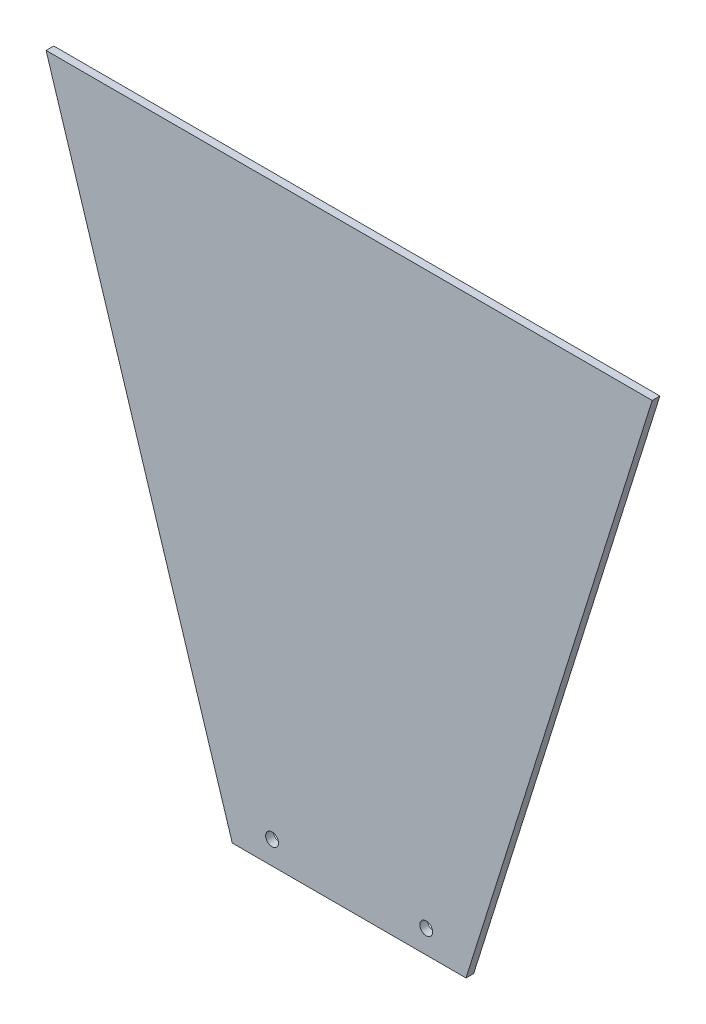
ISO-10303-21;
HEADER;
FILE_DESCRIPTION(('STEP AP214'),'2;1');
FILE_NAME('part.step','',(''),(''),'','','');
FILE_SCHEMA(('AUTOMOTIVE_DESIGN { 1 0 10303 214 1 1 1 1 }'));
ENDSEC;
DATA;
#1=APPLICATION_CONTEXT('core data for automotive mechanical design processes');
#2=APPLICATION_PROTOCOL_DEFINITION('international standard','automotive_design',2000,#1);
#3=PRODUCT_CONTEXT('',#1,'mechanical');
#4=PRODUCT('Part','Part','',(#3));
#5=PRODUCT_RELATED_PRODUCT_CATEGORY('part','',(#4));
#6=PRODUCT_DEFINITION_FORMATION('','',#4);
#7=PRODUCT_DEFINITION_CONTEXT('part definition',#1,'design');
#8=PRODUCT_DEFINITION('design','',#6,#7);
#9=PRODUCT_DEFINITION_SHAPE('','',#8);
#10=(LENGTH_UNIT() NAMED_UNIT(*) SI_UNIT(.MILLI.,.METRE.));
#11=(NAMED_UNIT(*) PLANE_ANGLE_UNIT() SI_UNIT($,.RADIAN.));
#12=(NAMED_UNIT(*) SI_UNIT($,.STERADIAN.) SOLID_ANGLE_UNIT());
#13=UNCERTAINTY_MEASURE_WITH_UNIT(LENGTH_MEASURE(1.E-05),#10,'distance_accuracy_value','');
#14=(GEOMETRIC_REPRESENTATION_CONTEXT(3) GLOBAL_UNCERTAINTY_ASSIGNED_CONTEXT((#13)) GLOBAL_UNIT_ASSIGNED_CONTEXT((#10,
#11,#12)) REPRESENTATION_CONTEXT('',''));
#15=CARTESIAN_POINT('',(0.,0.,0.));
#16=DIRECTION('',(0.,0.,1.));
#17=DIRECTION('',(1.,0.,0.));
#18=AXIS2_PLACEMENT_3D('',#15,#16,#17);
#19=CARTESIAN_POINT('',(0.,0.,3.));
#20=DIRECTION('',(0.,0.,-1.));
#21=DIRECTION('',(-1.,0.,0.));
#22=AXIS2_PLACEMENT_3D('',#19,#20,#21);
#23=PLANE('',#22);
#24=DIRECTION('',(1.,0.,0.));
#25=VECTOR('',#24,1.);
#26=CARTESIAN_POINT('',(-45.5,0.,3.));
#27=LINE('',#26,#25);
#28=CARTESIAN_POINT('',(-45.5,0.,3.));
#29=VERTEX_POINT('',#28);
#30=CARTESIAN_POINT('',(45.5,0.,3.));
#31=VERTEX_POINT('',#30);
#32=EDGE_CURVE('E85',#29,#31,#27,.T.);
#33=ORIENTED_EDGE('',*,*,#32,.T.);
#34=DIRECTION('',(0.299450668285817,0.954111784469293,0.));
#35=VECTOR('',#34,1.);
#36=CARTESIAN_POINT('',(118.,231.,3.));
#37=LINE('',#36,#35);
#38=CARTESIAN_POINT('',(118.,231.,3.));
#39=VERTEX_POINT('',#38);
#40=EDGE_CURVE('E80',#31,#39,#37,.T.);
#41=ORIENTED_EDGE('',*,*,#40,.T.);
#42=DIRECTION('',(-1.,0.,0.));
#43=VECTOR('',#42,1.);
#44=CARTESIAN_POINT('',(-118.,231.,3.));
#45=LINE('',#44,#43);
#46=CARTESIAN_POINT('',(-118.,231.,3.));
#47=VERTEX_POINT('',#46);
#48=EDGE_CURVE('E83',#39,#47,#45,.T.);
#49=ORIENTED_EDGE('',*,*,#48,.T.);
#50=DIRECTION('',(0.299450668285817,-0.954111784469292,0.));
#51=VECTOR('',#50,1.);
#52=CARTESIAN_POINT('',(-45.5,0.,3.));
#53=LINE('',#52,#51);
#54=EDGE_CURVE('E50',#47,#29,#53,.T.);
#55=ORIENTED_EDGE('',*,*,#54,.T.);
#56=EDGE_LOOP('',(#33,#41,#49,#55));
#57=FACE_BOUND('',#56,.T.);
#58=CARTESIAN_POINT('',(-30.,9.,3.));
#59=DIRECTION('',(0.,0.,1.));
#60=DIRECTION('',(1.,0.,0.));
#61=AXIS2_PLACEMENT_3D('',#58,#59,#60);
#62=CIRCLE('',#61,2.5);
#63=CARTESIAN_POINT('',(-27.5,9.,3.));
#64=VERTEX_POINT('',#63);
#65=EDGE_CURVE('E100',#64,#64,#62,.T.);
#66=ORIENTED_EDGE('',*,*,#65,.F.);
#67=EDGE_LOOP('',(#66));
#68=FACE_BOUND('',#67,.T.);
#69=CARTESIAN_POINT('',(30.,9.,3.));
#70=DIRECTION('',(0.,0.,1.));
#71=DIRECTION('',(1.,0.,0.));
#72=AXIS2_PLACEMENT_3D('',#69,#70,#71);
#73=CIRCLE('',#72,2.5);
#74=CARTESIAN_POINT('',(32.5,9.,3.));
#75=VERTEX_POINT('',#74);
#76=EDGE_CURVE('E115',#75,#75,#73,.T.);
#77=ORIENTED_EDGE('',*,*,#76,.F.);
#78=EDGE_LOOP('',(#77));
#79=FACE_BOUND('',#78,.T.);
#80=ADVANCED_FACE('F33',(#57,#68,#79),#23,.F.);
#81=CARTESIAN_POINT('',(0.,0.,0.));
#82=DIRECTION('',(0.,0.,-1.));
#83=DIRECTION('',(-1.,0.,0.));
#84=AXIS2_PLACEMENT_3D('',#81,#82,#83);
#85=PLANE('',#84);
#86=CARTESIAN_POINT('',(-30.,9.,0.));
#87=DIRECTION('',(0.,0.,1.));
#88=DIRECTION('',(1.,0.,0.));
#89=AXIS2_PLACEMENT_3D('',#86,#87,#88);
#90=CIRCLE('',#89,2.5);
#91=CARTESIAN_POINT('',(-27.5,9.,0.));
#92=VERTEX_POINT('',#91);
#93=EDGE_CURVE('E112',#92,#92,#90,.T.);
#94=ORIENTED_EDGE('',*,*,#93,.T.);
#95=EDGE_LOOP('',(#94));
#96=FACE_BOUND('',#95,.T.);
#97=DIRECTION('',(1.,0.,0.));
#98=VECTOR('',#97,1.);
#99=CARTESIAN_POINT('',(-45.5,0.,0.));
#100=LINE('',#99,#98);
#101=CARTESIAN_POINT('',(-45.5,0.,0.));
#102=VERTEX_POINT('',#101);
#103=CARTESIAN_POINT('',(45.5,0.,0.));
#104=VERTEX_POINT('',#103);
#105=EDGE_CURVE('E97',#102,#104,#100,.T.);
#106=ORIENTED_EDGE('',*,*,#105,.F.);
#107=DIRECTION('',(0.299450668285817,-0.954111784469292,0.));
#108=VECTOR('',#107,1.);
#109=CARTESIAN_POINT('',(-45.5,0.,0.));
#110=LINE('',#109,#108);
#111=CARTESIAN_POINT('',(-118.,231.,0.));
#112=VERTEX_POINT('',#111);
#113=EDGE_CURVE('E73',#112,#102,#110,.T.);
#114=ORIENTED_EDGE('',*,*,#113,.F.);
#115=DIRECTION('',(-1.,0.,0.));
#116=VECTOR('',#115,1.);
#117=CARTESIAN_POINT('',(-118.,231.,0.));
#118=LINE('',#117,#116);
#119=CARTESIAN_POINT('',(118.,231.,0.));
#120=VERTEX_POINT('',#119);
#121=EDGE_CURVE('E67',#120,#112,#118,.T.);
#122=ORIENTED_EDGE('',*,*,#121,.F.);
#123=DIRECTION('',(0.299450668285817,0.954111784469293,0.));
#124=VECTOR('',#123,1.);
#125=CARTESIAN_POINT('',(118.,231.,0.));
#126=LINE('',#125,#124);
#127=EDGE_CURVE('E89',#104,#120,#126,.T.);
#128=ORIENTED_EDGE('',*,*,#127,.F.);
#129=EDGE_LOOP('',(#106,#114,#122,#128));
#130=FACE_BOUND('',#129,.T.);
#131=CARTESIAN_POINT('',(30.,9.,0.));
#132=DIRECTION('',(0.,0.,1.));
#133=DIRECTION('',(1.,0.,0.));
#134=AXIS2_PLACEMENT_3D('',#131,#132,#133);
#135=CIRCLE('',#134,2.5);
#136=CARTESIAN_POINT('',(32.5,9.,0.));
#137=VERTEX_POINT('',#136);
#138=EDGE_CURVE('E118',#137,#137,#135,.T.);
#139=ORIENTED_EDGE('',*,*,#138,.T.);
#140=EDGE_LOOP('',(#139));
#141=FACE_BOUND('',#140,.T.);
#142=ADVANCED_FACE('F108',(#96,#130,#141),#85,.T.);
#143=CARTESIAN_POINT('',(-45.5,0.,3.));
#144=DIRECTION('',(0.,1.,0.));
#145=DIRECTION('',(0.,0.,1.));
#146=AXIS2_PLACEMENT_3D('',#143,#144,#145);
#147=PLANE('',#146);
#148=ORIENTED_EDGE('',*,*,#105,.T.);
#149=DIRECTION('',(0.,0.,-1.));
#150=VECTOR('',#149,1.);
#151=CARTESIAN_POINT('',(45.5,0.,3.));
#152=LINE('',#151,#150);
#153=EDGE_CURVE('E11',#31,#104,#152,.T.);
#154=ORIENTED_EDGE('',*,*,#153,.F.);
#155=ORIENTED_EDGE('',*,*,#32,.F.);
#156=DIRECTION('',(0.,0.,-1.));
#157=VECTOR('',#156,1.);
#158=CARTESIAN_POINT('',(-45.5,0.,3.));
#159=LINE('',#158,#157);
#160=EDGE_CURVE('E93',#29,#102,#159,.T.);
#161=ORIENTED_EDGE('',*,*,#160,.T.);
#162=EDGE_LOOP('',(#148,#154,#155,#161));
#163=FACE_BOUND('',#162,.T.);
#164=ADVANCED_FACE('F35',(#163),#147,.F.);
#165=CARTESIAN_POINT('',(118.,231.,3.));
#166=DIRECTION('',(-0.954111784469293,0.299450668285817,0.));
#167=DIRECTION('',(-0.299450668285817,-0.954111784469293,0.));
#168=AXIS2_PLACEMENT_3D('',#165,#166,#167);
#169=PLANE('',#168);
#170=ORIENTED_EDGE('',*,*,#127,.T.);
#171=DIRECTION('',(0.,0.,-1.));
#172=VECTOR('',#171,1.);
#173=CARTESIAN_POINT('',(118.,231.,3.));
#174=LINE('',#173,#172);
#175=EDGE_CURVE('E42',#39,#120,#174,.T.);
#176=ORIENTED_EDGE('',*,*,#175,.F.);
#177=ORIENTED_EDGE('',*,*,#40,.F.);
#178=ORIENTED_EDGE('',*,*,#153,.T.);
#179=EDGE_LOOP('',(#170,#176,#177,#178));
#180=FACE_BOUND('',#179,.T.);
#181=ADVANCED_FACE('F88',(#180),#169,.F.);
#182=CARTESIAN_POINT('',(-118.,231.,3.));
#183=DIRECTION('',(0.,-1.,0.));
#184=DIRECTION('',(0.,0.,-1.));
#185=AXIS2_PLACEMENT_3D('',#182,#183,#184);
#186=PLANE('',#185);
#187=ORIENTED_EDGE('',*,*,#121,.T.);
#188=DIRECTION('',(0.,0.,-1.));
#189=VECTOR('',#188,1.);
#190=CARTESIAN_POINT('',(-118.,231.,3.));
#191=LINE('',#190,#189);
#192=EDGE_CURVE('E90',#47,#112,#191,.T.);
#193=ORIENTED_EDGE('',*,*,#192,.F.);
#194=ORIENTED_EDGE('',*,*,#48,.F.);
#195=ORIENTED_EDGE('',*,*,#175,.T.);
#196=EDGE_LOOP('',(#187,#193,#194,#195));
#197=FACE_BOUND('',#196,.T.);
#198=ADVANCED_FACE('F91',(#197),#186,.F.);
#199=CARTESIAN_POINT('',(-45.5,0.,3.));
#200=DIRECTION('',(0.954111784469292,0.299450668285817,0.));
#201=DIRECTION('',(-0.299450668285817,0.954111784469292,0.));
#202=AXIS2_PLACEMENT_3D('',#199,#200,#201);
#203=PLANE('',#202);
#204=ORIENTED_EDGE('',*,*,#113,.T.);
#205=ORIENTED_EDGE('',*,*,#160,.F.);
#206=ORIENTED_EDGE('',*,*,#54,.F.);
#207=ORIENTED_EDGE('',*,*,#192,.T.);
#208=EDGE_LOOP('',(#204,#205,#206,#207));
#209=FACE_BOUND('',#208,.T.);
#210=ADVANCED_FACE('F105',(#209),#203,.F.);
#211=CARTESIAN_POINT('',(-30.,9.,3.));
#212=DIRECTION('',(0.,0.,-1.));
#213=DIRECTION('',(-1.,0.,0.));
#214=AXIS2_PLACEMENT_3D('',#211,#212,#213);
#215=CYLINDRICAL_SURFACE('',#214,2.5);
#216=ORIENTED_EDGE('',*,*,#65,.T.);
#217=EDGE_LOOP('',(#216));
#218=FACE_BOUND('',#217,.T.);
#219=ORIENTED_EDGE('',*,*,#93,.F.);
#220=EDGE_LOOP('',(#219));
#221=FACE_BOUND('',#220,.T.);
#222=ADVANCED_FACE('F135',(#218,#221),#215,.F.);
#223=CARTESIAN_POINT('',(30.,9.,3.));
#224=DIRECTION('',(0.,0.,-1.));
#225=DIRECTION('',(-1.,0.,0.));
#226=AXIS2_PLACEMENT_3D('',#223,#224,#225);
#227=CYLINDRICAL_SURFACE('',#226,2.5);
#228=ORIENTED_EDGE('',*,*,#76,.T.);
#229=EDGE_LOOP('',(#228));
#230=FACE_BOUND('',#229,.T.);
#231=ORIENTED_EDGE('',*,*,#138,.F.);
#232=EDGE_LOOP('',(#231));
#233=FACE_BOUND('',#232,.T.);
#234=ADVANCED_FACE('F124',(#230,#233),#227,.F.);
#235=CLOSED_SHELL('',(#80,#142,#164,#181,#198,#210,#222,#234));
#236=MANIFOLD_SOLID_BREP('B2',#235);
#237=ADVANCED_BREP_SHAPE_REPRESENTATION('',(#18,#236),#14);
#238=SHAPE_DEFINITION_REPRESENTATION(#9,#237);
ENDSEC;
END-ISO-10303-21;
